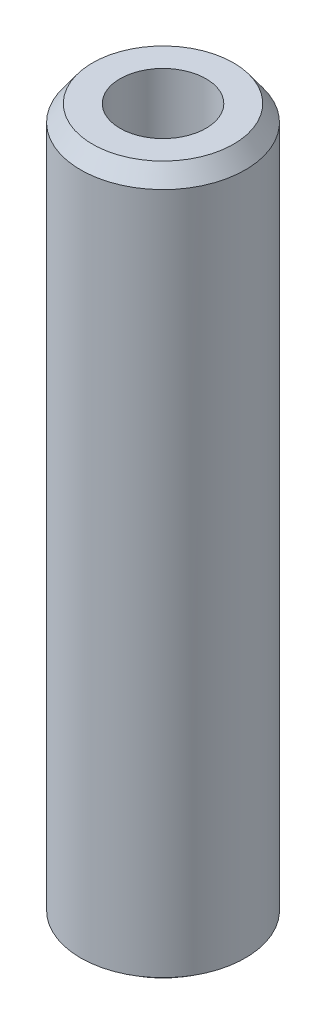
ISO-10303-21;
HEADER;
FILE_DESCRIPTION(('STEP AP214'),'2;1');
FILE_NAME('part.step','',(''),(''),'','','');
FILE_SCHEMA(('AUTOMOTIVE_DESIGN { 1 0 10303 214 1 1 1 1 }'));
ENDSEC;
DATA;
#1=APPLICATION_CONTEXT('core data for automotive mechanical design processes');
#2=APPLICATION_PROTOCOL_DEFINITION('international standard','automotive_design',2000,#1);
#3=PRODUCT_CONTEXT('',#1,'mechanical');
#4=PRODUCT('Part','Part','',(#3));
#5=PRODUCT_RELATED_PRODUCT_CATEGORY('part','',(#4));
#6=PRODUCT_DEFINITION_FORMATION('','',#4);
#7=PRODUCT_DEFINITION_CONTEXT('part definition',#1,'design');
#8=PRODUCT_DEFINITION('design','',#6,#7);
#9=PRODUCT_DEFINITION_SHAPE('','',#8);
#10=(LENGTH_UNIT() NAMED_UNIT(*) SI_UNIT(.MILLI.,.METRE.));
#11=(NAMED_UNIT(*) PLANE_ANGLE_UNIT() SI_UNIT($,.RADIAN.));
#12=(NAMED_UNIT(*) SI_UNIT($,.STERADIAN.) SOLID_ANGLE_UNIT());
#13=UNCERTAINTY_MEASURE_WITH_UNIT(LENGTH_MEASURE(1.E-05),#10,'distance_accuracy_value','');
#14=(GEOMETRIC_REPRESENTATION_CONTEXT(3) GLOBAL_UNCERTAINTY_ASSIGNED_CONTEXT((#13)) GLOBAL_UNIT_ASSIGNED_CONTEXT((#10,
#11,#12)) REPRESENTATION_CONTEXT('',''));
#15=CARTESIAN_POINT('',(0.,0.,0.));
#16=DIRECTION('',(0.,0.,1.));
#17=DIRECTION('',(1.,0.,0.));
#18=AXIS2_PLACEMENT_3D('',#15,#16,#17);
#19=CARTESIAN_POINT('',(0.,129.423228324941,0.));
#20=DIRECTION('',(0.,-1.,0.));
#21=DIRECTION('',(0.,0.,-1.));
#22=AXIS2_PLACEMENT_3D('',#19,#20,#21);
#23=CYLINDRICAL_SURFACE('',#22,15.);
#24=CARTESIAN_POINT('',(0.,126.449555051945,0.));
#25=DIRECTION('',(0.,1.,0.));
#26=DIRECTION('',(0.,0.,1.));
#27=AXIS2_PLACEMENT_3D('',#24,#25,#26);
#28=CIRCLE('',#27,15.);
#29=CARTESIAN_POINT('',(0.,126.449555051945,-15.));
#30=VERTEX_POINT('',#29);
#31=EDGE_CURVE('E50',#30,#30,#28,.F.);
#32=ORIENTED_EDGE('',*,*,#31,.T.);
#33=EDGE_LOOP('',(#32));
#34=FACE_BOUND('',#33,.T.);
#35=CARTESIAN_POINT('',(0.,2.15615644996686,0.));
#36=DIRECTION('',(0.,1.,0.));
#37=DIRECTION('',(0.,0.,1.));
#38=AXIS2_PLACEMENT_3D('',#35,#36,#37);
#39=CIRCLE('',#38,15.);
#40=CARTESIAN_POINT('',(0.,2.15615644996686,15.));
#41=VERTEX_POINT('',#40);
#42=EDGE_CURVE('E51',#41,#41,#39,.T.);
#43=ORIENTED_EDGE('',*,*,#42,.T.);
#44=EDGE_LOOP('',(#43));
#45=FACE_BOUND('',#44,.T.);
#46=ADVANCED_FACE('F39',(#34,#45),#23,.T.);
#47=CARTESIAN_POINT('',(0.,129.423228324941,0.));
#48=DIRECTION('',(0.,1.,0.));
#49=DIRECTION('',(0.,0.,1.));
#50=AXIS2_PLACEMENT_3D('',#47,#48,#49);
#51=PLANE('',#50);
#52=CARTESIAN_POINT('',(0.,129.423228324941,0.));
#53=DIRECTION('',(0.,1.,0.));
#54=DIRECTION('',(0.,0.,1.));
#55=AXIS2_PLACEMENT_3D('',#52,#53,#54);
#56=CIRCLE('',#55,12.8438435500331);
#57=CARTESIAN_POINT('',(0.,129.42322832494,-12.8438435500332));
#58=VERTEX_POINT('',#57);
#59=EDGE_CURVE('E54',#58,#58,#56,.T.);
#60=ORIENTED_EDGE('',*,*,#59,.T.);
#61=EDGE_LOOP('',(#60));
#62=FACE_BOUND('',#61,.T.);
#63=CARTESIAN_POINT('',(0.,129.423228324941,0.));
#64=DIRECTION('',(0.,1.,0.));
#65=DIRECTION('',(0.,0.,1.));
#66=AXIS2_PLACEMENT_3D('',#63,#64,#65);
#67=CIRCLE('',#66,7.83038762173929);
#68=CARTESIAN_POINT('',(0.,129.423228324941,7.83038762173929));
#69=VERTEX_POINT('',#68);
#70=EDGE_CURVE('E58',#69,#69,#67,.T.);
#71=ORIENTED_EDGE('',*,*,#70,.F.);
#72=EDGE_LOOP('',(#71));
#73=FACE_BOUND('',#72,.T.);
#74=ADVANCED_FACE('F69',(#62,#73),#51,.T.);
#75=CARTESIAN_POINT('',(0.,0.,0.));
#76=DIRECTION('',(0.,1.,0.));
#77=DIRECTION('',(0.,0.,1.));
#78=AXIS2_PLACEMENT_3D('',#75,#76,#77);
#79=PLANE('',#78);
#80=CARTESIAN_POINT('',(0.,0.,0.));
#81=DIRECTION('',(0.,1.,0.));
#82=DIRECTION('',(0.,0.,1.));
#83=AXIS2_PLACEMENT_3D('',#80,#81,#82);
#84=CIRCLE('',#83,12.0263267270047);
#85=CARTESIAN_POINT('',(0.,0.,12.0263267270047));
#86=VERTEX_POINT('',#85);
#87=EDGE_CURVE('E10',#86,#86,#84,.F.);
#88=ORIENTED_EDGE('',*,*,#87,.T.);
#89=EDGE_LOOP('',(#88));
#90=FACE_BOUND('',#89,.T.);
#91=CARTESIAN_POINT('',(0.,0.,0.));
#92=DIRECTION('',(0.,1.,0.));
#93=DIRECTION('',(0.,0.,1.));
#94=AXIS2_PLACEMENT_3D('',#91,#92,#93);
#95=CIRCLE('',#94,7.83038762173929);
#96=CARTESIAN_POINT('',(0.,0.,7.83038762173929));
#97=VERTEX_POINT('',#96);
#98=EDGE_CURVE('E63',#97,#97,#95,.T.);
#99=ORIENTED_EDGE('',*,*,#98,.T.);
#100=EDGE_LOOP('',(#99));
#101=FACE_BOUND('',#100,.T.);
#102=ADVANCED_FACE('F75',(#90,#101),#79,.F.);
#103=CARTESIAN_POINT('',(0.,129.423228324941,0.));
#104=DIRECTION('',(0.,-1.,0.));
#105=DIRECTION('',(0.,0.,-1.));
#106=AXIS2_PLACEMENT_3D('',#103,#104,#105);
#107=CYLINDRICAL_SURFACE('',#106,7.83038762173929);
#108=ORIENTED_EDGE('',*,*,#70,.T.);
#109=EDGE_LOOP('',(#108));
#110=FACE_BOUND('',#109,.T.);
#111=ORIENTED_EDGE('',*,*,#98,.F.);
#112=EDGE_LOOP('',(#111));
#113=FACE_BOUND('',#112,.T.);
#114=ADVANCED_FACE('F70',(#110,#113),#107,.F.);
#115=CARTESIAN_POINT('',(0.,129.423228324941,0.));
#116=DIRECTION('',(0.,-1.,0.));
#117=DIRECTION('',(0.,0.,-1.));
#118=AXIS2_PLACEMENT_3D('',#115,#116,#117);
#119=CONICAL_SURFACE('',#118,12.8438435500331,0.627361825319996);
#120=CARTESIAN_POINT('',(0.,126.449555051945,-15.));
#121=CARTESIAN_POINT('',(0.,126.480530815206,-14.9775400369795));
#122=CARTESIAN_POINT('',(0.,126.511506578466,-14.955080073959));
#123=CARTESIAN_POINT('',(0.,126.573458104987,-14.9101601479181));
#124=CARTESIAN_POINT('',(0.,126.604433868247,-14.8877001848976));
#125=CARTESIAN_POINT('',(0.,126.666385394768,-14.8427802588566));
#126=CARTESIAN_POINT('',(0.,126.697361158028,-14.8203202958361));
#127=CARTESIAN_POINT('',(0.,126.759312684549,-14.7754003697951));
#128=CARTESIAN_POINT('',(0.,126.790288447809,-14.7529404067746));
#129=CARTESIAN_POINT('',(0.,126.85223997433,-14.7080204807337));
#130=CARTESIAN_POINT('',(0.,126.88321573759,-14.6855605177132));
#131=CARTESIAN_POINT('',(0.,126.945167264111,-14.6406405916722));
#132=CARTESIAN_POINT('',(0.,126.976143027371,-14.6181806286517));
#133=CARTESIAN_POINT('',(0.,127.038094553892,-14.5732607026107));
#134=CARTESIAN_POINT('',(0.,127.069070317153,-14.5508007395902));
#135=CARTESIAN_POINT('',(0.,127.131021843673,-14.5058808135493));
#136=CARTESIAN_POINT('',(0.,127.161997606934,-14.4834208505288));
#137=CARTESIAN_POINT('',(0.,127.223949133454,-14.4385009244878));
#138=CARTESIAN_POINT('',(0.,127.254924896715,-14.4160409614673));
#139=CARTESIAN_POINT('',(0.,127.316876423235,-14.3711210354263));
#140=CARTESIAN_POINT('',(0.,127.347852186496,-14.3486610724059));
#141=CARTESIAN_POINT('',(0.,127.409803713017,-14.3037411463649));
#142=CARTESIAN_POINT('',(0.,127.440779476277,-14.2812811833444));
#143=CARTESIAN_POINT('',(0.,127.502731002798,-14.2363612573034));
#144=CARTESIAN_POINT('',(0.,127.533706766058,-14.2139012942829));
#145=CARTESIAN_POINT('',(0.,127.595658292579,-14.168981368242));
#146=CARTESIAN_POINT('',(0.,127.626634055839,-14.1465214052215));
#147=CARTESIAN_POINT('',(0.,127.68858558236,-14.1016014791805));
#148=CARTESIAN_POINT('',(0.,127.71956134562,-14.07914151616));
#149=CARTESIAN_POINT('',(0.,127.781512872141,-14.034221590119));
#150=CARTESIAN_POINT('',(0.,127.812488635401,-14.0117616270985));
#151=CARTESIAN_POINT('',(0.,127.874440161922,-13.9668417010576));
#152=CARTESIAN_POINT('',(0.,127.905415925182,-13.9443817380371));
#153=CARTESIAN_POINT('',(0.,127.967367451703,-13.8994618119961));
#154=CARTESIAN_POINT('',(0.,127.998343214964,-13.8770018489756));
#155=CARTESIAN_POINT('',(0.,128.060294741484,-13.8320819229346));
#156=CARTESIAN_POINT('',(0.,128.091270504745,-13.8096219599141));
#157=CARTESIAN_POINT('',(0.,128.153222031265,-13.7647020338732));
#158=CARTESIAN_POINT('',(0.,128.184197794526,-13.7422420708527));
#159=CARTESIAN_POINT('',(0.,128.246149321047,-13.6973221448117));
#160=CARTESIAN_POINT('',(0.,128.277125084307,-13.6748621817912));
#161=CARTESIAN_POINT('',(0.,128.339076610828,-13.6299422557502));
#162=CARTESIAN_POINT('',(0.,128.370052374088,-13.6074822927298));
#163=CARTESIAN_POINT('',(0.,128.432003900609,-13.5625623666888));
#164=CARTESIAN_POINT('',(0.,128.462979663869,-13.5401024036683));
#165=CARTESIAN_POINT('',(0.,128.52493119039,-13.4951824776273));
#166=CARTESIAN_POINT('',(0.,128.55590695365,-13.4727225146068));
#167=CARTESIAN_POINT('',(0.,128.617858480171,-13.4278025885659));
#168=CARTESIAN_POINT('',(0.,128.648834243431,-13.4053426255454));
#169=CARTESIAN_POINT('',(0.,128.710785769952,-13.3604226995044));
#170=CARTESIAN_POINT('',(0.,128.741761533212,-13.3379627364839));
#171=CARTESIAN_POINT('',(0.,128.803713059733,-13.2930428104429));
#172=CARTESIAN_POINT('',(0.,128.834688822994,-13.2705828474224));
#173=CARTESIAN_POINT('',(0.,128.896640349514,-13.2256629213815));
#174=CARTESIAN_POINT('',(0.,128.927616112775,-13.203202958361));
#175=CARTESIAN_POINT('',(0.,128.989567639295,-13.15828303232));
#176=CARTESIAN_POINT('',(0.,129.020543402556,-13.1358230692995));
#177=CARTESIAN_POINT('',(0.,129.082494929076,-13.0909031432585));
#178=CARTESIAN_POINT('',(0.,129.113470692337,-13.068443180238));
#179=CARTESIAN_POINT('',(0.,129.175422218858,-13.0235232541971));
#180=CARTESIAN_POINT('',(0.,129.206397982118,-13.0010632911766));
#181=CARTESIAN_POINT('',(0.,129.268349508639,-12.9561433651356));
#182=CARTESIAN_POINT('',(0.,129.299325271899,-12.9336834021151));
#183=CARTESIAN_POINT('',(0.,129.36127679842,-12.8887634760741));
#184=CARTESIAN_POINT('',(0.,129.39225256168,-12.8663035130536));
#185=CARTESIAN_POINT('',(0.,129.423228324941,-12.8438435500332));
#186=B_SPLINE_CURVE_WITH_KNOTS('',3,(#120,#121,#122,#123,#124,#125,#126,#127,#128,#129,#130,
#131,#132,#133,#134,#135,#136,#137,#138,#139,#140,#141,#142,#143,#144,#145,#146,#147,#148,#149,
#150,#151,#152,#153,#154,#155,#156,#157,#158,#159,#160,#161,#162,#163,#164,#165,#166,#167,#168,
#169,#170,#171,#172,#173,#174,#175,#176,#177,#178,#179,#180,#181,#182,#183,#184,#185),
.UNSPECIFIED.,.F.,.F.,(4,2,2,2,2,2,2,2,2,2,2,2,2,2,2,2,2,2,2,2,2,2,2,2,2,2,2,2,2,2,2,2,4),(0.,
0.114784714295925,0.229569428591852,0.344354142887777,0.459138857183703,0.573923571479629,
0.688708285775531,0.803493000071457,0.918277714367383,1.03306242866331,1.14784714295924,
1.26263185725514,1.37741657155106,1.49220128584699,1.60698600014292,1.72177071443884,
1.83655542873474,1.95134014303067,2.0661248573266,2.18090957162252,2.29569428591845,
2.41047900021437,2.52526371451028,2.6400484288062,2.75483314310213,2.86961785739805,
2.98440257169398,3.09918728598988,3.21397200028581,3.32875671458173,3.44354142887766,
3.55832614317359,3.67311085746951),.UNSPECIFIED.);
#187=EDGE_CURVE('BSEAM81',#30,#58,#186,.T.);
#188=ORIENTED_EDGE('',*,*,#31,.F.);
#189=ORIENTED_EDGE('',*,*,#59,.F.);
#190=ORIENTED_EDGE('',*,*,#187,.T.);
#191=ORIENTED_EDGE('',*,*,#187,.F.);
#192=EDGE_LOOP('',(#188,#190,#189,#191));
#193=FACE_BOUND('',#192,.T.);
#194=ADVANCED_FACE('F81',(#193),#119,.T.);
#195=CARTESIAN_POINT('',(0.,2.15615644996686,0.));
#196=DIRECTION('',(0.,1.,0.));
#197=DIRECTION('',(0.,0.,1.));
#198=AXIS2_PLACEMENT_3D('',#195,#196,#197);
#199=CONICAL_SURFACE('',#198,15.,0.9434345014749);
#200=ORIENTED_EDGE('',*,*,#87,.F.);
#201=EDGE_LOOP('',(#200));
#202=FACE_BOUND('',#201,.T.);
#203=ORIENTED_EDGE('',*,*,#42,.F.);
#204=EDGE_LOOP('',(#203));
#205=FACE_BOUND('',#204,.T.);
#206=ADVANCED_FACE('F45',(#202,#205),#199,.T.);
#207=CLOSED_SHELL('',(#46,#74,#102,#114,#194,#206));
#208=MANIFOLD_SOLID_BREP('B2',#207);
#209=ADVANCED_BREP_SHAPE_REPRESENTATION('',(#18,#208),#14);
#210=SHAPE_DEFINITION_REPRESENTATION(#9,#209);
ENDSEC;
END-ISO-10303-21;
